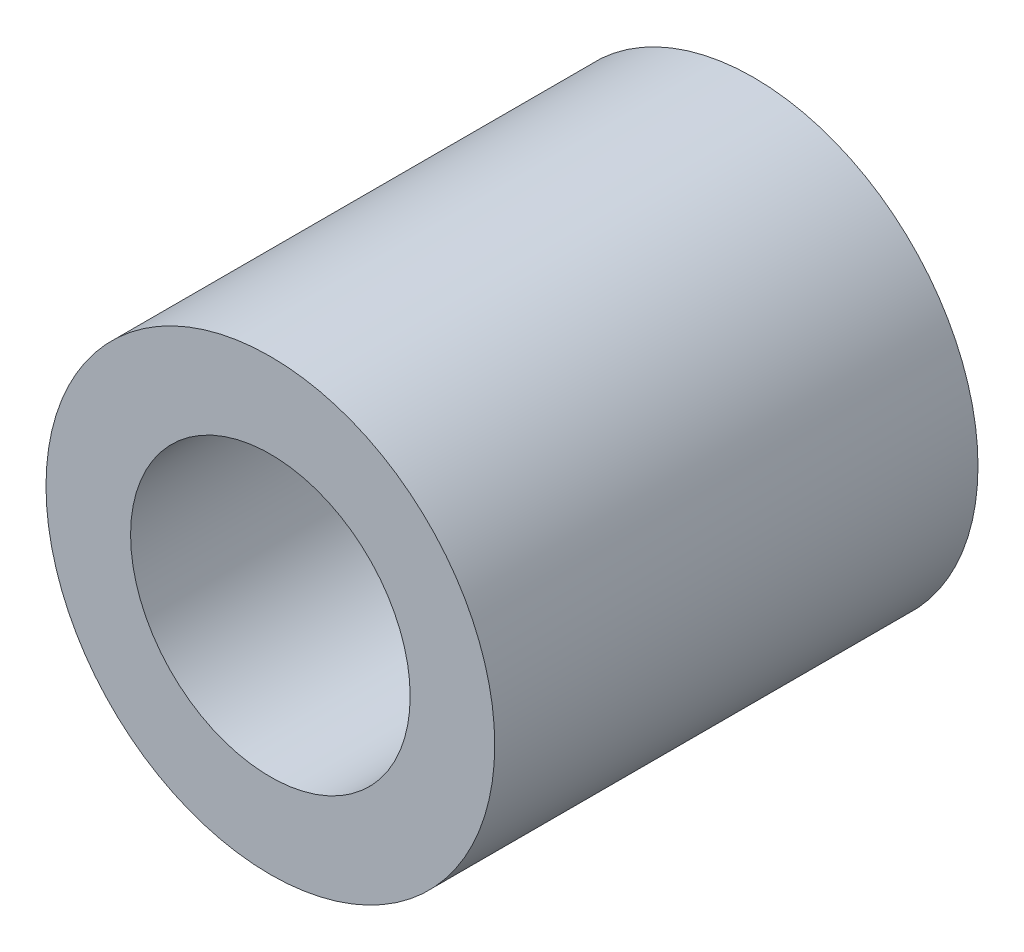
ISO-10303-21;
HEADER;
FILE_DESCRIPTION(('STEP AP214'),'2;1');
FILE_NAME('part.step','',(''),(''),'','','');
FILE_SCHEMA(('AUTOMOTIVE_DESIGN { 1 0 10303 214 1 1 1 1 }'));
ENDSEC;
DATA;
#1=APPLICATION_CONTEXT('core data for automotive mechanical design processes');
#2=APPLICATION_PROTOCOL_DEFINITION('international standard','automotive_design',2000,#1);
#3=PRODUCT_CONTEXT('',#1,'mechanical');
#4=PRODUCT('Part','Part','',(#3));
#5=PRODUCT_RELATED_PRODUCT_CATEGORY('part','',(#4));
#6=PRODUCT_DEFINITION_FORMATION('','',#4);
#7=PRODUCT_DEFINITION_CONTEXT('part definition',#1,'design');
#8=PRODUCT_DEFINITION('design','',#6,#7);
#9=PRODUCT_DEFINITION_SHAPE('','',#8);
#10=(LENGTH_UNIT() NAMED_UNIT(*) SI_UNIT(.MILLI.,.METRE.));
#11=(NAMED_UNIT(*) PLANE_ANGLE_UNIT() SI_UNIT($,.RADIAN.));
#12=(NAMED_UNIT(*) SI_UNIT($,.STERADIAN.) SOLID_ANGLE_UNIT());
#13=UNCERTAINTY_MEASURE_WITH_UNIT(LENGTH_MEASURE(1.E-05),#10,'distance_accuracy_value','');
#14=(GEOMETRIC_REPRESENTATION_CONTEXT(3) GLOBAL_UNCERTAINTY_ASSIGNED_CONTEXT((#13)) GLOBAL_UNIT_ASSIGNED_CONTEXT((#10,
#11,#12)) REPRESENTATION_CONTEXT('',''));
#15=CARTESIAN_POINT('',(0.,0.,0.));
#16=DIRECTION('',(0.,0.,1.));
#17=DIRECTION('',(1.,0.,0.));
#18=AXIS2_PLACEMENT_3D('',#15,#16,#17);
#19=CARTESIAN_POINT('',(0.,0.,14.));
#20=DIRECTION('',(0.,0.,1.));
#21=DIRECTION('',(1.,0.,0.));
#22=AXIS2_PLACEMENT_3D('',#19,#20,#21);
#23=PLANE('',#22);
#24=CARTESIAN_POINT('',(0.,0.,14.));
#25=DIRECTION('',(0.,0.,1.));
#26=DIRECTION('',(1.,0.,0.));
#27=AXIS2_PLACEMENT_3D('',#24,#25,#26);
#28=CIRCLE('',#27,6.5);
#29=CARTESIAN_POINT('',(6.5,0.,14.));
#30=VERTEX_POINT('',#29);
#31=EDGE_CURVE('E10',#30,#30,#28,.T.);
#32=ORIENTED_EDGE('',*,*,#31,.T.);
#33=EDGE_LOOP('',(#32));
#34=FACE_BOUND('',#33,.T.);
#35=CARTESIAN_POINT('',(0.,0.,14.));
#36=DIRECTION('',(0.,0.,1.));
#37=DIRECTION('',(1.,0.,0.));
#38=AXIS2_PLACEMENT_3D('',#35,#36,#37);
#39=CIRCLE('',#38,4.05);
#40=CARTESIAN_POINT('',(4.05,0.,14.));
#41=VERTEX_POINT('',#40);
#42=EDGE_CURVE('E48',#41,#41,#39,.T.);
#43=ORIENTED_EDGE('',*,*,#42,.F.);
#44=EDGE_LOOP('',(#43));
#45=FACE_BOUND('',#44,.T.);
#46=ADVANCED_FACE('F37',(#34,#45),#23,.T.);
#47=CARTESIAN_POINT('',(0.,0.,0.));
#48=DIRECTION('',(0.,0.,1.));
#49=DIRECTION('',(1.,0.,0.));
#50=AXIS2_PLACEMENT_3D('',#47,#48,#49);
#51=PLANE('',#50);
#52=CARTESIAN_POINT('',(0.,0.,0.));
#53=DIRECTION('',(0.,0.,1.));
#54=DIRECTION('',(1.,0.,0.));
#55=AXIS2_PLACEMENT_3D('',#52,#53,#54);
#56=CIRCLE('',#55,6.5);
#57=CARTESIAN_POINT('',(6.5,0.,0.));
#58=VERTEX_POINT('',#57);
#59=EDGE_CURVE('E41',#58,#58,#56,.T.);
#60=ORIENTED_EDGE('',*,*,#59,.F.);
#61=EDGE_LOOP('',(#60));
#62=FACE_BOUND('',#61,.T.);
#63=CARTESIAN_POINT('',(0.,0.,0.));
#64=DIRECTION('',(0.,0.,1.));
#65=DIRECTION('',(1.,0.,0.));
#66=AXIS2_PLACEMENT_3D('',#63,#64,#65);
#67=CIRCLE('',#66,4.05);
#68=CARTESIAN_POINT('',(4.05,0.,0.));
#69=VERTEX_POINT('',#68);
#70=EDGE_CURVE('E50',#69,#69,#67,.T.);
#71=ORIENTED_EDGE('',*,*,#70,.T.);
#72=EDGE_LOOP('',(#71));
#73=FACE_BOUND('',#72,.T.);
#74=ADVANCED_FACE('F60',(#62,#73),#51,.F.);
#75=CARTESIAN_POINT('',(0.,0.,14.));
#76=DIRECTION('',(0.,0.,-1.));
#77=DIRECTION('',(-1.,0.,0.));
#78=AXIS2_PLACEMENT_3D('',#75,#76,#77);
#79=CYLINDRICAL_SURFACE('',#78,6.5);
#80=ORIENTED_EDGE('',*,*,#31,.F.);
#81=EDGE_LOOP('',(#80));
#82=FACE_BOUND('',#81,.T.);
#83=ORIENTED_EDGE('',*,*,#59,.T.);
#84=EDGE_LOOP('',(#83));
#85=FACE_BOUND('',#84,.T.);
#86=ADVANCED_FACE('F39',(#82,#85),#79,.T.);
#87=CARTESIAN_POINT('',(0.,0.,14.));
#88=DIRECTION('',(0.,0.,-1.));
#89=DIRECTION('',(-1.,0.,0.));
#90=AXIS2_PLACEMENT_3D('',#87,#88,#89);
#91=CYLINDRICAL_SURFACE('',#90,4.05);
#92=ORIENTED_EDGE('',*,*,#42,.T.);
#93=EDGE_LOOP('',(#92));
#94=FACE_BOUND('',#93,.T.);
#95=ORIENTED_EDGE('',*,*,#70,.F.);
#96=EDGE_LOOP('',(#95));
#97=FACE_BOUND('',#96,.T.);
#98=ADVANCED_FACE('F56',(#94,#97),#91,.F.);
#99=CLOSED_SHELL('',(#46,#74,#86,#98));
#100=MANIFOLD_SOLID_BREP('B2',#99);
#101=ADVANCED_BREP_SHAPE_REPRESENTATION('',(#18,#100),#14);
#102=SHAPE_DEFINITION_REPRESENTATION(#9,#101);
ENDSEC;
END-ISO-10303-21;
